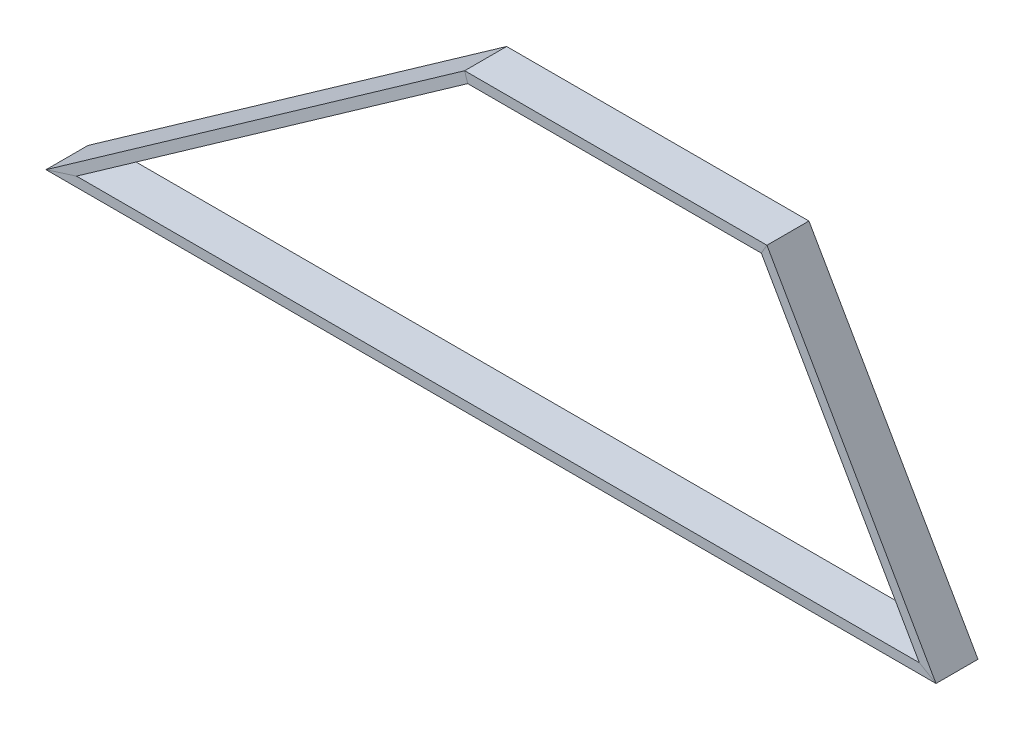
ISO-10303-21;
HEADER;
FILE_DESCRIPTION(('STEP AP214'),'2;1');
FILE_NAME('part.step','',(''),(''),'','','');
FILE_SCHEMA(('AUTOMOTIVE_DESIGN { 1 0 10303 214 1 1 1 1 }'));
ENDSEC;
DATA;
#1=APPLICATION_CONTEXT('core data for automotive mechanical design processes');
#2=APPLICATION_PROTOCOL_DEFINITION('international standard','automotive_design',2000,#1);
#3=PRODUCT_CONTEXT('',#1,'mechanical');
#4=PRODUCT('Part','Part','',(#3));
#5=PRODUCT_RELATED_PRODUCT_CATEGORY('part','',(#4));
#6=PRODUCT_DEFINITION_FORMATION('','',#4);
#7=PRODUCT_DEFINITION_CONTEXT('part definition',#1,'design');
#8=PRODUCT_DEFINITION('design','',#6,#7);
#9=PRODUCT_DEFINITION_SHAPE('','',#8);
#10=(LENGTH_UNIT() NAMED_UNIT(*) SI_UNIT(.MILLI.,.METRE.));
#11=(NAMED_UNIT(*) PLANE_ANGLE_UNIT() SI_UNIT($,.RADIAN.));
#12=(NAMED_UNIT(*) SI_UNIT($,.STERADIAN.) SOLID_ANGLE_UNIT());
#13=UNCERTAINTY_MEASURE_WITH_UNIT(LENGTH_MEASURE(1.E-05),#10,'distance_accuracy_value','');
#14=(GEOMETRIC_REPRESENTATION_CONTEXT(3) GLOBAL_UNCERTAINTY_ASSIGNED_CONTEXT((#13)) GLOBAL_UNIT_ASSIGNED_CONTEXT((#10,
#11,#12)) REPRESENTATION_CONTEXT('',''));
#15=CARTESIAN_POINT('',(0.,0.,0.));
#16=DIRECTION('',(0.,0.,1.));
#17=DIRECTION('',(1.,0.,0.));
#18=AXIS2_PLACEMENT_3D('',#15,#16,#17);
#19=CARTESIAN_POINT('',(853.285159380692,360.705110908312,1.98740201703485E-13));
#20=DIRECTION('',(0.867623225673676,0.497222222222222,0.));
#21=DIRECTION('',(-0.497222222222222,0.867623225673676,0.));
#22=AXIS2_PLACEMENT_3D('',#19,#20,#21);
#23=PLANE('',#22);
#24=DIRECTION('',(0.,0.,1.));
#25=VECTOR('',#24,1.);
#26=CARTESIAN_POINT('',(858.625,351.387406397839,1.93606361295287E-13));
#27=LINE('',#26,#25);
#28=CARTESIAN_POINT('',(858.625,351.387406397839,-49.9999999999998));
#29=VERTEX_POINT('',#28);
#30=CARTESIAN_POINT('',(858.625,351.387406397839,1.93606361295287E-13));
#31=VERTEX_POINT('',#30);
#32=EDGE_CURVE('E170',#29,#31,#27,.T.);
#33=ORIENTED_EDGE('',*,*,#32,.T.);
#34=DIRECTION('',(0.497222222222222,-0.867623225673676,0.));
#35=VECTOR('',#34,1.);
#36=CARTESIAN_POINT('',(853.285159380692,360.705110908312,1.98740201703485E-13));
#37=LINE('',#36,#35);
#38=CARTESIAN_POINT('',(1060.,-1.38777878078145E-13,0.));
#39=VERTEX_POINT('',#38);
#40=EDGE_CURVE('E146',#31,#39,#37,.T.);
#41=ORIENTED_EDGE('',*,*,#40,.T.);
#42=DIRECTION('',(0.,0.,1.));
#43=VECTOR('',#42,1.);
#44=CARTESIAN_POINT('',(1060.,-2.22044604925031E-13,0.));
#45=LINE('',#44,#43);
#46=CARTESIAN_POINT('',(1060.,0.,-50.));
#47=VERTEX_POINT('',#46);
#48=EDGE_CURVE('E140',#47,#39,#45,.T.);
#49=ORIENTED_EDGE('',*,*,#48,.F.);
#50=DIRECTION('',(0.497222222222222,-0.867623225673676,0.));
#51=VECTOR('',#50,1.);
#52=CARTESIAN_POINT('',(853.285159380692,360.705110908312,-49.9999999999998));
#53=LINE('',#52,#51);
#54=EDGE_CURVE('E101',#29,#47,#53,.T.);
#55=ORIENTED_EDGE('',*,*,#54,.F.);
#56=EDGE_LOOP('',(#33,#41,#49,#55));
#57=FACE_BOUND('',#56,.T.);
#58=ADVANCED_FACE('F39',(#57),#23,.T.);
#59=CARTESIAN_POINT('',(851.418128415301,340.792446712522,1.87768782727027E-13));
#60=DIRECTION('',(-0.867623225673676,-0.497222222222222,0.));
#61=DIRECTION('',(0.497222222222222,-0.867623225673676,0.));
#62=AXIS2_PLACEMENT_3D('',#59,#60,#61);
#63=PLANE('',#62);
#64=DIRECTION('',(0.497222222222222,-0.867623225673676,0.));
#65=VECTOR('',#64,1.);
#66=CARTESIAN_POINT('',(851.418128415301,340.792446712522,-49.9999999999998));
#67=LINE('',#66,#65);
#68=CARTESIAN_POINT('',(851.948770491803,339.866507827418,-49.9999999999998));
#69=VERTEX_POINT('',#68);
#70=CARTESIAN_POINT('',(1040.11885245902,11.5208985704209,-50.));
#71=VERTEX_POINT('',#70);
#72=EDGE_CURVE('E43',#69,#71,#67,.T.);
#73=ORIENTED_EDGE('',*,*,#72,.T.);
#74=DIRECTION('',(0.,0.,1.));
#75=VECTOR('',#74,1.);
#76=CARTESIAN_POINT('',(1040.11885245902,11.5208985704207,0.));
#77=LINE('',#76,#75);
#78=CARTESIAN_POINT('',(1040.11885245902,11.5208985704208,0.));
#79=VERTEX_POINT('',#78);
#80=EDGE_CURVE('E108',#71,#79,#77,.T.);
#81=ORIENTED_EDGE('',*,*,#80,.T.);
#82=DIRECTION('',(0.497222222222222,-0.867623225673676,0.));
#83=VECTOR('',#82,1.);
#84=CARTESIAN_POINT('',(851.418128415301,340.792446712522,1.87768782727027E-13));
#85=LINE('',#84,#83);
#86=CARTESIAN_POINT('',(851.948770491803,339.866507827418,1.87258611744622E-13));
#87=VERTEX_POINT('',#86);
#88=EDGE_CURVE('E117',#87,#79,#85,.T.);
#89=ORIENTED_EDGE('',*,*,#88,.F.);
#90=DIRECTION('',(0.,0.,1.));
#91=VECTOR('',#90,1.);
#92=CARTESIAN_POINT('',(851.948770491803,339.866507827418,0.));
#93=LINE('',#92,#91);
#94=EDGE_CURVE('E115',#69,#87,#93,.T.);
#95=ORIENTED_EDGE('',*,*,#94,.F.);
#96=EDGE_LOOP('',(#73,#81,#89,#95));
#97=FACE_BOUND('',#96,.T.);
#98=ADVANCED_FACE('F112',(#97),#63,.T.);
#99=CARTESIAN_POINT('',(853.285159380692,360.705110908312,-49.9999999999998));
#100=DIRECTION('',(0.,0.,-1.));
#101=DIRECTION('',(0.,1.,0.));
#102=AXIS2_PLACEMENT_3D('',#99,#100,#101);
#103=PLANE('',#102);
#104=ORIENTED_EDGE('',*,*,#54,.T.);
#105=DIRECTION('',(-0.865223156827827,0.501386965216378,0.));
#106=VECTOR('',#105,1.);
#107=CARTESIAN_POINT('',(1060.,-1.71976832734887E-13,-50.));
#108=LINE('',#107,#106);
#109=EDGE_CURVE('E96',#47,#71,#108,.T.);
#110=ORIENTED_EDGE('',*,*,#109,.T.);
#111=ORIENTED_EDGE('',*,*,#72,.F.);
#112=DIRECTION('',(-0.501386965216378,-0.865223156827827,0.));
#113=VECTOR('',#112,1.);
#114=CARTESIAN_POINT('',(764.588864981785,189.113060950435,-49.9999999999999));
#115=LINE('',#114,#113);
#116=EDGE_CURVE('E181',#29,#69,#115,.T.);
#117=ORIENTED_EDGE('',*,*,#116,.F.);
#118=EDGE_LOOP('',(#104,#110,#111,#117));
#119=FACE_BOUND('',#118,.T.);
#120=ADVANCED_FACE('F98',(#119),#103,.T.);
#121=CARTESIAN_POINT('',(853.285159380692,360.705110908312,1.98740201703485E-13));
#122=DIRECTION('',(0.,0.,1.));
#123=DIRECTION('',(0.,-1.,0.));
#124=AXIS2_PLACEMENT_3D('',#121,#122,#123);
#125=PLANE('',#124);
#126=ORIENTED_EDGE('',*,*,#88,.T.);
#127=DIRECTION('',(0.865223156827827,-0.501386965216378,0.));
#128=VECTOR('',#127,1.);
#129=CARTESIAN_POINT('',(1060.,-2.22044604925031E-13,0.));
#130=LINE('',#129,#128);
#131=EDGE_CURVE('E89',#79,#39,#130,.T.);
#132=ORIENTED_EDGE('',*,*,#131,.T.);
#133=ORIENTED_EDGE('',*,*,#40,.F.);
#134=DIRECTION('',(0.501386965216378,0.865223156827827,0.));
#135=VECTOR('',#134,1.);
#136=CARTESIAN_POINT('',(764.588864981785,189.113060950435,1.04196937446801E-13));
#137=LINE('',#136,#135);
#138=EDGE_CURVE('E107',#87,#31,#137,.T.);
#139=ORIENTED_EDGE('',*,*,#138,.F.);
#140=EDGE_LOOP('',(#126,#132,#133,#139));
#141=FACE_BOUND('',#140,.T.);
#142=ADVANCED_FACE('F41',(#141),#125,.T.);
#143=CARTESIAN_POINT('',(1060.,-2.22044604925031E-13,0.));
#144=DIRECTION('',(0.,-1.,0.));
#145=DIRECTION('',(0.,0.,-1.));
#146=AXIS2_PLACEMENT_3D('',#143,#144,#145);
#147=PLANE('',#146);
#148=DIRECTION('',(-1.,0.,0.));
#149=VECTOR('',#148,1.);
#150=CARTESIAN_POINT('',(1060.,-2.22044604925031E-13,0.));
#151=LINE('',#150,#149);
#152=CARTESIAN_POINT('',(0.,-1.11022302462516E-13,0.));
#153=VERTEX_POINT('',#152);
#154=EDGE_CURVE('E138',#39,#153,#151,.T.);
#155=ORIENTED_EDGE('',*,*,#154,.T.);
#156=DIRECTION('',(0.,0.,1.));
#157=VECTOR('',#156,1.);
#158=CARTESIAN_POINT('',(0.,0.,0.));
#159=LINE('',#158,#157);
#160=CARTESIAN_POINT('',(0.,0.,-50.));
#161=VERTEX_POINT('',#160);
#162=EDGE_CURVE('E232',#161,#153,#159,.T.);
#163=ORIENTED_EDGE('',*,*,#162,.F.);
#164=DIRECTION('',(-1.,0.,0.));
#165=VECTOR('',#164,1.);
#166=CARTESIAN_POINT('',(1060.,-1.71976832734887E-13,-50.));
#167=LINE('',#166,#165);
#168=EDGE_CURVE('E134',#47,#161,#167,.T.);
#169=ORIENTED_EDGE('',*,*,#168,.F.);
#170=ORIENTED_EDGE('',*,*,#48,.T.);
#171=EDGE_LOOP('',(#155,#163,#169,#170));
#172=FACE_BOUND('',#171,.T.);
#173=ADVANCED_FACE('F164',(#172),#147,.T.);
#174=CARTESIAN_POINT('',(1043.65163934426,11.5208985704207,0.));
#175=DIRECTION('',(0.,1.,0.));
#176=DIRECTION('',(0.,0.,1.));
#177=AXIS2_PLACEMENT_3D('',#174,#175,#176);
#178=PLANE('',#177);
#179=DIRECTION('',(-1.,0.,0.));
#180=VECTOR('',#179,1.);
#181=CARTESIAN_POINT('',(1043.65163934426,11.5208985704208,-50.));
#182=LINE('',#181,#180);
#183=CARTESIAN_POINT('',(36.3483606557374,11.5208985704209,-50.));
#184=VERTEX_POINT('',#183);
#185=EDGE_CURVE('E123',#71,#184,#182,.T.);
#186=ORIENTED_EDGE('',*,*,#185,.T.);
#187=DIRECTION('',(0.,0.,1.));
#188=VECTOR('',#187,1.);
#189=CARTESIAN_POINT('',(36.3483606557377,11.520898570421,0.));
#190=LINE('',#189,#188);
#191=CARTESIAN_POINT('',(36.3483606557374,11.5208985704209,0.));
#192=VERTEX_POINT('',#191);
#193=EDGE_CURVE('E226',#184,#192,#190,.T.);
#194=ORIENTED_EDGE('',*,*,#193,.T.);
#195=DIRECTION('',(-1.,0.,0.));
#196=VECTOR('',#195,1.);
#197=CARTESIAN_POINT('',(1043.65163934426,11.5208985704207,0.));
#198=LINE('',#197,#196);
#199=EDGE_CURVE('E126',#79,#192,#198,.T.);
#200=ORIENTED_EDGE('',*,*,#199,.F.);
#201=ORIENTED_EDGE('',*,*,#80,.F.);
#202=EDGE_LOOP('',(#186,#194,#200,#201));
#203=FACE_BOUND('',#202,.T.);
#204=ADVANCED_FACE('F121',(#203),#178,.T.);
#205=CARTESIAN_POINT('',(1060.,-1.71976832734887E-13,-50.));
#206=DIRECTION('',(0.,0.,-1.));
#207=DIRECTION('',(0.,1.,0.));
#208=AXIS2_PLACEMENT_3D('',#205,#206,#207);
#209=PLANE('',#208);
#210=ORIENTED_EDGE('',*,*,#168,.T.);
#211=DIRECTION('',(0.953262301989039,0.302143978272872,0.));
#212=VECTOR('',#211,1.);
#213=CARTESIAN_POINT('',(0.,0.,-50.));
#214=LINE('',#213,#212);
#215=EDGE_CURVE('E132',#161,#184,#214,.T.);
#216=ORIENTED_EDGE('',*,*,#215,.T.);
#217=ORIENTED_EDGE('',*,*,#185,.F.);
#218=ORIENTED_EDGE('',*,*,#109,.F.);
#219=EDGE_LOOP('',(#210,#216,#217,#218));
#220=FACE_BOUND('',#219,.T.);
#221=ADVANCED_FACE('F130',(#220),#209,.T.);
#222=CARTESIAN_POINT('',(1060.,-2.22044604925031E-13,0.));
#223=DIRECTION('',(0.,0.,1.));
#224=DIRECTION('',(0.,-1.,0.));
#225=AXIS2_PLACEMENT_3D('',#222,#223,#224);
#226=PLANE('',#225);
#227=ORIENTED_EDGE('',*,*,#199,.T.);
#228=DIRECTION('',(-0.953262301989039,-0.302143978272872,0.));
#229=VECTOR('',#228,1.);
#230=CARTESIAN_POINT('',(0.,0.,0.));
#231=LINE('',#230,#229);
#232=EDGE_CURVE('E237',#192,#153,#231,.T.);
#233=ORIENTED_EDGE('',*,*,#232,.T.);
#234=ORIENTED_EDGE('',*,*,#154,.F.);
#235=ORIENTED_EDGE('',*,*,#131,.F.);
#236=EDGE_LOOP('',(#227,#233,#234,#235));
#237=FACE_BOUND('',#236,.T.);
#238=ADVANCED_FACE('F152',(#237),#226,.T.);
#239=CARTESIAN_POINT('',(484.558606557377,351.387406397839,1.93606361295201E-13));
#240=DIRECTION('',(0.,1.,0.));
#241=DIRECTION('',(0.,0.,1.));
#242=AXIS2_PLACEMENT_3D('',#239,#240,#241);
#243=PLANE('',#242);
#244=DIRECTION('',(0.,0.,1.));
#245=VECTOR('',#244,1.);
#246=CARTESIAN_POINT('',(498.625,351.387406397839,1.93606361295205E-13));
#247=LINE('',#246,#245);
#248=CARTESIAN_POINT('',(498.625,351.387406397839,-49.9999999999998));
#249=VERTEX_POINT('',#248);
#250=CARTESIAN_POINT('',(498.625,351.387406397839,1.93606361295205E-13));
#251=VERTEX_POINT('',#250);
#252=EDGE_CURVE('E187',#249,#251,#247,.T.);
#253=ORIENTED_EDGE('',*,*,#252,.T.);
#254=DIRECTION('',(1.,0.,0.));
#255=VECTOR('',#254,1.);
#256=CARTESIAN_POINT('',(484.558606557377,351.387406397839,1.93606361295201E-13));
#257=LINE('',#256,#255);
#258=EDGE_CURVE('E177',#251,#31,#257,.T.);
#259=ORIENTED_EDGE('',*,*,#258,.T.);
#260=ORIENTED_EDGE('',*,*,#32,.F.);
#261=DIRECTION('',(1.,0.,0.));
#262=VECTOR('',#261,1.);
#263=CARTESIAN_POINT('',(484.558606557377,351.387406397839,-49.9999999999998));
#264=LINE('',#263,#262);
#265=EDGE_CURVE('E189',#249,#29,#264,.T.);
#266=ORIENTED_EDGE('',*,*,#265,.F.);
#267=EDGE_LOOP('',(#253,#259,#260,#266));
#268=FACE_BOUND('',#267,.T.);
#269=ADVANCED_FACE('F185',(#268),#243,.T.);
#270=CARTESIAN_POINT('',(500.906967213115,339.866507827418,1.87258611744542E-13));
#271=DIRECTION('',(0.,-1.,0.));
#272=DIRECTION('',(0.,0.,-1.));
#273=AXIS2_PLACEMENT_3D('',#270,#271,#272);
#274=PLANE('',#273);
#275=DIRECTION('',(1.,0.,0.));
#276=VECTOR('',#275,1.);
#277=CARTESIAN_POINT('',(500.906967213115,339.866507827418,-49.9999999999998));
#278=LINE('',#277,#276);
#279=CARTESIAN_POINT('',(502.276639344262,339.866507827418,-49.9999999999998));
#280=VERTEX_POINT('',#279);
#281=EDGE_CURVE('E194',#280,#69,#278,.T.);
#282=ORIENTED_EDGE('',*,*,#281,.T.);
#283=ORIENTED_EDGE('',*,*,#94,.T.);
#284=DIRECTION('',(1.,0.,0.));
#285=VECTOR('',#284,1.);
#286=CARTESIAN_POINT('',(500.906967213115,339.866507827418,1.87258611744542E-13));
#287=LINE('',#286,#285);
#288=CARTESIAN_POINT('',(502.276639344262,339.866507827418,1.87258611744542E-13));
#289=VERTEX_POINT('',#288);
#290=EDGE_CURVE('E179',#289,#87,#287,.T.);
#291=ORIENTED_EDGE('',*,*,#290,.F.);
#292=DIRECTION('',(0.,0.,1.));
#293=VECTOR('',#292,1.);
#294=CARTESIAN_POINT('',(502.276639344262,339.866507827418,1.03035519823432E-13));
#295=LINE('',#294,#293);
#296=EDGE_CURVE('E210',#280,#289,#295,.T.);
#297=ORIENTED_EDGE('',*,*,#296,.F.);
#298=EDGE_LOOP('',(#282,#283,#291,#297));
#299=FACE_BOUND('',#298,.T.);
#300=ADVANCED_FACE('F208',(#299),#274,.T.);
#301=CARTESIAN_POINT('',(484.558606557377,351.387406397839,-49.9999999999998));
#302=DIRECTION('',(0.,0.,-1.));
#303=DIRECTION('',(0.,1.,0.));
#304=AXIS2_PLACEMENT_3D('',#301,#302,#303);
#305=PLANE('',#304);
#306=ORIENTED_EDGE('',*,*,#265,.T.);
#307=ORIENTED_EDGE('',*,*,#116,.T.);
#308=ORIENTED_EDGE('',*,*,#281,.F.);
#309=DIRECTION('',(0.302143978272871,-0.953262301989039,0.));
#310=VECTOR('',#309,1.);
#311=CARTESIAN_POINT('',(554.3125,175.69370319892,-49.9999999999999));
#312=LINE('',#311,#310);
#313=EDGE_CURVE('E50',#249,#280,#312,.T.);
#314=ORIENTED_EDGE('',*,*,#313,.F.);
#315=EDGE_LOOP('',(#306,#307,#308,#314));
#316=FACE_BOUND('',#315,.T.);
#317=ADVANCED_FACE('F211',(#316),#305,.T.);
#318=CARTESIAN_POINT('',(484.558606557377,351.387406397839,1.93606361295201E-13));
#319=DIRECTION('',(0.,0.,1.));
#320=DIRECTION('',(0.,-1.,0.));
#321=AXIS2_PLACEMENT_3D('',#318,#319,#320);
#322=PLANE('',#321);
#323=ORIENTED_EDGE('',*,*,#290,.T.);
#324=ORIENTED_EDGE('',*,*,#138,.T.);
#325=ORIENTED_EDGE('',*,*,#258,.F.);
#326=DIRECTION('',(-0.302143978272871,0.953262301989039,0.));
#327=VECTOR('',#326,1.);
#328=CARTESIAN_POINT('',(554.3125,175.69370319892,0.));
#329=LINE('',#328,#327);
#330=EDGE_CURVE('E11',#289,#251,#329,.T.);
#331=ORIENTED_EDGE('',*,*,#330,.F.);
#332=EDGE_LOOP('',(#323,#324,#325,#331));
#333=FACE_BOUND('',#332,.T.);
#334=ADVANCED_FACE('F175',(#333),#322,.T.);
#335=CARTESIAN_POINT('',(0.,0.,0.));
#336=DIRECTION('',(-0.576044928521047,0.817418032786885,0.));
#337=DIRECTION('',(-0.817418032786885,-0.576044928521047,0.));
#338=AXIS2_PLACEMENT_3D('',#335,#336,#337);
#339=PLANE('',#338);
#340=DIRECTION('',(0.817418032786885,0.576044928521047,0.));
#341=VECTOR('',#340,1.);
#342=CARTESIAN_POINT('',(0.,0.,0.));
#343=LINE('',#342,#341);
#344=EDGE_CURVE('E242',#153,#251,#343,.T.);
#345=ORIENTED_EDGE('',*,*,#344,.T.);
#346=ORIENTED_EDGE('',*,*,#252,.F.);
#347=DIRECTION('',(0.817418032786885,0.576044928521047,0.));
#348=VECTOR('',#347,1.);
#349=CARTESIAN_POINT('',(0.,0.,-50.));
#350=LINE('',#349,#348);
#351=EDGE_CURVE('E219',#161,#249,#350,.T.);
#352=ORIENTED_EDGE('',*,*,#351,.F.);
#353=ORIENTED_EDGE('',*,*,#162,.T.);
#354=EDGE_LOOP('',(#345,#346,#352,#353));
#355=FACE_BOUND('',#354,.T.);
#356=ADVANCED_FACE('F253',(#355),#339,.T.);
#357=CARTESIAN_POINT('',(20.,0.,0.));
#358=DIRECTION('',(0.576044928521047,-0.817418032786885,0.));
#359=DIRECTION('',(0.817418032786885,0.576044928521047,0.));
#360=AXIS2_PLACEMENT_3D('',#357,#358,#359);
#361=PLANE('',#360);
#362=ORIENTED_EDGE('',*,*,#193,.F.);
#363=DIRECTION('',(0.817418032786885,0.576044928521047,0.));
#364=VECTOR('',#363,1.);
#365=CARTESIAN_POINT('',(20.,0.,-50.));
#366=LINE('',#365,#364);
#367=EDGE_CURVE('E217',#184,#280,#366,.T.);
#368=ORIENTED_EDGE('',*,*,#367,.T.);
#369=ORIENTED_EDGE('',*,*,#296,.T.);
#370=DIRECTION('',(0.817418032786885,0.576044928521047,0.));
#371=VECTOR('',#370,1.);
#372=CARTESIAN_POINT('',(20.,0.,0.));
#373=LINE('',#372,#371);
#374=EDGE_CURVE('E228',#192,#289,#373,.T.);
#375=ORIENTED_EDGE('',*,*,#374,.F.);
#376=EDGE_LOOP('',(#362,#368,#369,#375));
#377=FACE_BOUND('',#376,.T.);
#378=ADVANCED_FACE('F223',(#377),#361,.T.);
#379=CARTESIAN_POINT('',(0.,0.,-50.));
#380=DIRECTION('',(0.,0.,-1.));
#381=DIRECTION('',(0.,1.,0.));
#382=AXIS2_PLACEMENT_3D('',#379,#380,#381);
#383=PLANE('',#382);
#384=ORIENTED_EDGE('',*,*,#215,.F.);
#385=ORIENTED_EDGE('',*,*,#351,.T.);
#386=ORIENTED_EDGE('',*,*,#313,.T.);
#387=ORIENTED_EDGE('',*,*,#367,.F.);
#388=EDGE_LOOP('',(#384,#385,#386,#387));
#389=FACE_BOUND('',#388,.T.);
#390=ADVANCED_FACE('F216',(#389),#383,.T.);
#391=CARTESIAN_POINT('',(0.,0.,0.));
#392=DIRECTION('',(0.,0.,1.));
#393=DIRECTION('',(0.,-1.,0.));
#394=AXIS2_PLACEMENT_3D('',#391,#392,#393);
#395=PLANE('',#394);
#396=ORIENTED_EDGE('',*,*,#232,.F.);
#397=ORIENTED_EDGE('',*,*,#374,.T.);
#398=ORIENTED_EDGE('',*,*,#330,.T.);
#399=ORIENTED_EDGE('',*,*,#344,.F.);
#400=EDGE_LOOP('',(#396,#397,#398,#399));
#401=FACE_BOUND('',#400,.T.);
#402=ADVANCED_FACE('F257',(#401),#395,.T.);
#403=CLOSED_SHELL('',(#58,#98,#120,#142,#173,#204,#221,#238,#269,#300,#317,#334,#356,#378,#390,#402));
#404=MANIFOLD_SOLID_BREP('B2',#403);
#405=ADVANCED_BREP_SHAPE_REPRESENTATION('',(#18,#404),#14);
#406=SHAPE_DEFINITION_REPRESENTATION(#9,#405);
ENDSEC;
END-ISO-10303-21;
